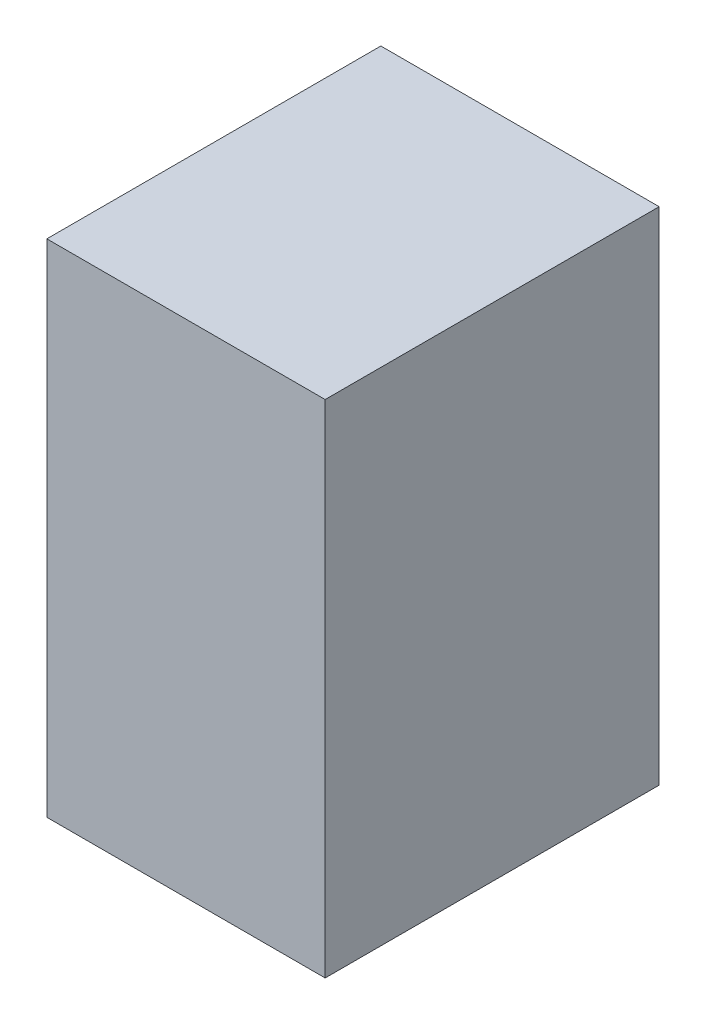
ISO-10303-21;
HEADER;
FILE_DESCRIPTION(('STEP AP214'),'2;1');
FILE_NAME('part.step','',(''),(''),'','','');
FILE_SCHEMA(('AUTOMOTIVE_DESIGN { 1 0 10303 214 1 1 1 1 }'));
ENDSEC;
DATA;
#1=APPLICATION_CONTEXT('core data for automotive mechanical design processes');
#2=APPLICATION_PROTOCOL_DEFINITION('international standard','automotive_design',2000,#1);
#3=PRODUCT_CONTEXT('',#1,'mechanical');
#4=PRODUCT('Part','Part','',(#3));
#5=PRODUCT_RELATED_PRODUCT_CATEGORY('part','',(#4));
#6=PRODUCT_DEFINITION_FORMATION('','',#4);
#7=PRODUCT_DEFINITION_CONTEXT('part definition',#1,'design');
#8=PRODUCT_DEFINITION('design','',#6,#7);
#9=PRODUCT_DEFINITION_SHAPE('','',#8);
#10=(LENGTH_UNIT() NAMED_UNIT(*) SI_UNIT(.MILLI.,.METRE.));
#11=(NAMED_UNIT(*) PLANE_ANGLE_UNIT() SI_UNIT($,.RADIAN.));
#12=(NAMED_UNIT(*) SI_UNIT($,.STERADIAN.) SOLID_ANGLE_UNIT());
#13=UNCERTAINTY_MEASURE_WITH_UNIT(LENGTH_MEASURE(1.E-05),#10,'distance_accuracy_value','');
#14=(GEOMETRIC_REPRESENTATION_CONTEXT(3) GLOBAL_UNCERTAINTY_ASSIGNED_CONTEXT((#13)) GLOBAL_UNIT_ASSIGNED_CONTEXT((#10,
#11,#12)) REPRESENTATION_CONTEXT('',''));
#15=CARTESIAN_POINT('',(0.,0.,0.));
#16=DIRECTION('',(0.,0.,1.));
#17=DIRECTION('',(1.,0.,0.));
#18=AXIS2_PLACEMENT_3D('',#15,#16,#17);
#19=CARTESIAN_POINT('',(25.,22.5,-15.));
#20=DIRECTION('',(0.,-1.,0.));
#21=DIRECTION('',(0.,0.,-1.));
#22=AXIS2_PLACEMENT_3D('',#19,#20,#21);
#23=PLANE('',#22);
#24=DIRECTION('',(0.,0.,1.));
#25=VECTOR('',#24,1.);
#26=CARTESIAN_POINT('',(0.,22.5,-15.));
#27=LINE('',#26,#25);
#28=CARTESIAN_POINT('',(0.,22.5,-15.));
#29=VERTEX_POINT('',#28);
#30=CARTESIAN_POINT('',(0.,22.5,15.));
#31=VERTEX_POINT('',#30);
#32=EDGE_CURVE('E102',#29,#31,#27,.T.);
#33=ORIENTED_EDGE('',*,*,#32,.T.);
#34=DIRECTION('',(-1.,0.,0.));
#35=VECTOR('',#34,1.);
#36=CARTESIAN_POINT('',(25.,22.5,15.));
#37=LINE('',#36,#35);
#38=CARTESIAN_POINT('',(25.,22.5,15.));
#39=VERTEX_POINT('',#38);
#40=EDGE_CURVE('E11',#39,#31,#37,.T.);
#41=ORIENTED_EDGE('',*,*,#40,.F.);
#42=DIRECTION('',(0.,0.,1.));
#43=VECTOR('',#42,1.);
#44=CARTESIAN_POINT('',(25.,22.5,-15.));
#45=LINE('',#44,#43);
#46=CARTESIAN_POINT('',(25.,22.5,-15.));
#47=VERTEX_POINT('',#46);
#48=EDGE_CURVE('E90',#47,#39,#45,.T.);
#49=ORIENTED_EDGE('',*,*,#48,.F.);
#50=DIRECTION('',(-1.,0.,0.));
#51=VECTOR('',#50,1.);
#52=CARTESIAN_POINT('',(25.,22.5,-15.));
#53=LINE('',#52,#51);
#54=EDGE_CURVE('E98',#47,#29,#53,.T.);
#55=ORIENTED_EDGE('',*,*,#54,.T.);
#56=EDGE_LOOP('',(#33,#41,#49,#55));
#57=FACE_BOUND('',#56,.T.);
#58=ADVANCED_FACE('F39',(#57),#23,.F.);
#59=CARTESIAN_POINT('',(25.,-22.5,15.));
#60=DIRECTION('',(0.,0.,-1.));
#61=DIRECTION('',(-1.,0.,0.));
#62=AXIS2_PLACEMENT_3D('',#59,#60,#61);
#63=PLANE('',#62);
#64=DIRECTION('',(0.,-1.,0.));
#65=VECTOR('',#64,1.);
#66=CARTESIAN_POINT('',(0.,-22.5,15.));
#67=LINE('',#66,#65);
#68=CARTESIAN_POINT('',(0.,-22.5,15.));
#69=VERTEX_POINT('',#68);
#70=EDGE_CURVE('E94',#31,#69,#67,.T.);
#71=ORIENTED_EDGE('',*,*,#70,.T.);
#72=DIRECTION('',(-1.,0.,0.));
#73=VECTOR('',#72,1.);
#74=CARTESIAN_POINT('',(25.,-22.5,15.));
#75=LINE('',#74,#73);
#76=CARTESIAN_POINT('',(25.,-22.5,15.));
#77=VERTEX_POINT('',#76);
#78=EDGE_CURVE('E47',#77,#69,#75,.T.);
#79=ORIENTED_EDGE('',*,*,#78,.F.);
#80=DIRECTION('',(0.,-1.,0.));
#81=VECTOR('',#80,1.);
#82=CARTESIAN_POINT('',(25.,-22.5,15.));
#83=LINE('',#82,#81);
#84=EDGE_CURVE('E85',#39,#77,#83,.T.);
#85=ORIENTED_EDGE('',*,*,#84,.F.);
#86=ORIENTED_EDGE('',*,*,#40,.T.);
#87=EDGE_LOOP('',(#71,#79,#85,#86));
#88=FACE_BOUND('',#87,.T.);
#89=ADVANCED_FACE('F93',(#88),#63,.F.);
#90=CARTESIAN_POINT('',(25.,-22.5,-15.));
#91=DIRECTION('',(0.,1.,0.));
#92=DIRECTION('',(0.,0.,1.));
#93=AXIS2_PLACEMENT_3D('',#90,#91,#92);
#94=PLANE('',#93);
#95=DIRECTION('',(0.,0.,-1.));
#96=VECTOR('',#95,1.);
#97=CARTESIAN_POINT('',(0.,-22.5,-15.));
#98=LINE('',#97,#96);
#99=CARTESIAN_POINT('',(0.,-22.5,-15.));
#100=VERTEX_POINT('',#99);
#101=EDGE_CURVE('E72',#69,#100,#98,.T.);
#102=ORIENTED_EDGE('',*,*,#101,.T.);
#103=DIRECTION('',(-1.,0.,0.));
#104=VECTOR('',#103,1.);
#105=CARTESIAN_POINT('',(25.,-22.5,-15.));
#106=LINE('',#105,#104);
#107=CARTESIAN_POINT('',(25.,-22.5,-15.));
#108=VERTEX_POINT('',#107);
#109=EDGE_CURVE('E95',#108,#100,#106,.T.);
#110=ORIENTED_EDGE('',*,*,#109,.F.);
#111=DIRECTION('',(0.,0.,-1.));
#112=VECTOR('',#111,1.);
#113=CARTESIAN_POINT('',(25.,-22.5,-15.));
#114=LINE('',#113,#112);
#115=EDGE_CURVE('E88',#77,#108,#114,.T.);
#116=ORIENTED_EDGE('',*,*,#115,.F.);
#117=ORIENTED_EDGE('',*,*,#78,.T.);
#118=EDGE_LOOP('',(#102,#110,#116,#117));
#119=FACE_BOUND('',#118,.T.);
#120=ADVANCED_FACE('F96',(#119),#94,.F.);
#121=CARTESIAN_POINT('',(25.,-22.5,-15.));
#122=DIRECTION('',(0.,0.,1.));
#123=DIRECTION('',(1.,0.,0.));
#124=AXIS2_PLACEMENT_3D('',#121,#122,#123);
#125=PLANE('',#124);
#126=DIRECTION('',(0.,1.,0.));
#127=VECTOR('',#126,1.);
#128=CARTESIAN_POINT('',(0.,-22.5,-15.));
#129=LINE('',#128,#127);
#130=EDGE_CURVE('E78',#100,#29,#129,.T.);
#131=ORIENTED_EDGE('',*,*,#130,.T.);
#132=ORIENTED_EDGE('',*,*,#54,.F.);
#133=DIRECTION('',(0.,1.,0.));
#134=VECTOR('',#133,1.);
#135=CARTESIAN_POINT('',(25.,-22.5,-15.));
#136=LINE('',#135,#134);
#137=EDGE_CURVE('E55',#108,#47,#136,.T.);
#138=ORIENTED_EDGE('',*,*,#137,.F.);
#139=ORIENTED_EDGE('',*,*,#109,.T.);
#140=EDGE_LOOP('',(#131,#132,#138,#139));
#141=FACE_BOUND('',#140,.T.);
#142=ADVANCED_FACE('F109',(#141),#125,.F.);
#143=CARTESIAN_POINT('',(25.,0.,0.));
#144=DIRECTION('',(-1.,0.,0.));
#145=DIRECTION('',(0.,0.,1.));
#146=AXIS2_PLACEMENT_3D('',#143,#144,#145);
#147=PLANE('',#146);
#148=ORIENTED_EDGE('',*,*,#48,.T.);
#149=ORIENTED_EDGE('',*,*,#84,.T.);
#150=ORIENTED_EDGE('',*,*,#115,.T.);
#151=ORIENTED_EDGE('',*,*,#137,.T.);
#152=EDGE_LOOP('',(#148,#149,#150,#151));
#153=FACE_BOUND('',#152,.T.);
#154=ADVANCED_FACE('F86',(#153),#147,.F.);
#155=CARTESIAN_POINT('',(0.,0.,0.));
#156=DIRECTION('',(-1.,0.,0.));
#157=DIRECTION('',(0.,0.,1.));
#158=AXIS2_PLACEMENT_3D('',#155,#156,#157);
#159=PLANE('',#158);
#160=ORIENTED_EDGE('',*,*,#32,.F.);
#161=ORIENTED_EDGE('',*,*,#130,.F.);
#162=ORIENTED_EDGE('',*,*,#101,.F.);
#163=ORIENTED_EDGE('',*,*,#70,.F.);
#164=EDGE_LOOP('',(#160,#161,#162,#163));
#165=FACE_BOUND('',#164,.T.);
#166=ADVANCED_FACE('F112',(#165),#159,.T.);
#167=CLOSED_SHELL('',(#58,#89,#120,#142,#154,#166));
#168=MANIFOLD_SOLID_BREP('B2',#167);
#169=ADVANCED_BREP_SHAPE_REPRESENTATION('',(#18,#168),#14);
#170=SHAPE_DEFINITION_REPRESENTATION(#9,#169);
ENDSEC;
END-ISO-10303-21;
